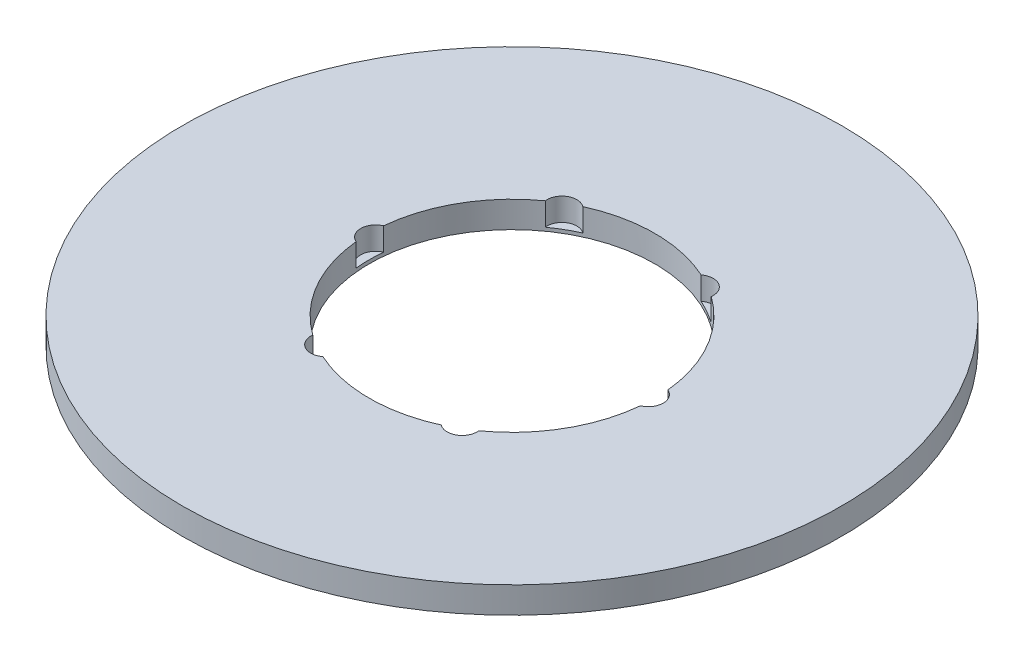
ISO-10303-21;
HEADER;
FILE_DESCRIPTION(('STEP AP214'),'2;1');
FILE_NAME('part.step','',(''),(''),'','','');
FILE_SCHEMA(('AUTOMOTIVE_DESIGN { 1 0 10303 214 1 1 1 1 }'));
ENDSEC;
DATA;
#1=APPLICATION_CONTEXT('core data for automotive mechanical design processes');
#2=APPLICATION_PROTOCOL_DEFINITION('international standard','automotive_design',2000,#1);
#3=PRODUCT_CONTEXT('',#1,'mechanical');
#4=PRODUCT('Part','Part','',(#3));
#5=PRODUCT_RELATED_PRODUCT_CATEGORY('part','',(#4));
#6=PRODUCT_DEFINITION_FORMATION('','',#4);
#7=PRODUCT_DEFINITION_CONTEXT('part definition',#1,'design');
#8=PRODUCT_DEFINITION('design','',#6,#7);
#9=PRODUCT_DEFINITION_SHAPE('','',#8);
#10=(LENGTH_UNIT() NAMED_UNIT(*) SI_UNIT(.MILLI.,.METRE.));
#11=(NAMED_UNIT(*) PLANE_ANGLE_UNIT() SI_UNIT($,.RADIAN.));
#12=(NAMED_UNIT(*) SI_UNIT($,.STERADIAN.) SOLID_ANGLE_UNIT());
#13=UNCERTAINTY_MEASURE_WITH_UNIT(LENGTH_MEASURE(1.E-05),#10,'distance_accuracy_value','');
#14=(GEOMETRIC_REPRESENTATION_CONTEXT(3) GLOBAL_UNCERTAINTY_ASSIGNED_CONTEXT((#13)) GLOBAL_UNIT_ASSIGNED_CONTEXT((#10,
#11,#12)) REPRESENTATION_CONTEXT('',''));
#15=CARTESIAN_POINT('',(0.,0.,0.));
#16=DIRECTION('',(0.,0.,1.));
#17=DIRECTION('',(1.,0.,0.));
#18=AXIS2_PLACEMENT_3D('',#15,#16,#17);
#19=CARTESIAN_POINT('',(0.,6.,0.));
#20=DIRECTION('',(0.,-1.,0.));
#21=DIRECTION('',(0.,0.,-1.));
#22=AXIS2_PLACEMENT_3D('',#19,#20,#21);
#23=CYLINDRICAL_SURFACE('',#22,75.);
#24=CARTESIAN_POINT('',(0.,6.,0.));
#25=DIRECTION('',(0.,1.,0.));
#26=DIRECTION('',(0.,0.,1.));
#27=AXIS2_PLACEMENT_3D('',#24,#25,#26);
#28=CIRCLE('',#27,75.);
#29=CARTESIAN_POINT('',(0.,6.,75.));
#30=VERTEX_POINT('',#29);
#31=EDGE_CURVE('E162',#30,#30,#28,.T.);
#32=ORIENTED_EDGE('',*,*,#31,.F.);
#33=EDGE_LOOP('',(#32));
#34=FACE_BOUND('',#33,.T.);
#35=CARTESIAN_POINT('',(0.,0.,0.));
#36=DIRECTION('',(0.,1.,0.));
#37=DIRECTION('',(0.,0.,1.));
#38=AXIS2_PLACEMENT_3D('',#35,#36,#37);
#39=CIRCLE('',#38,75.);
#40=CARTESIAN_POINT('',(0.,0.,75.));
#41=VERTEX_POINT('',#40);
#42=EDGE_CURVE('E157',#41,#41,#39,.T.);
#43=ORIENTED_EDGE('',*,*,#42,.T.);
#44=EDGE_LOOP('',(#43));
#45=FACE_BOUND('',#44,.T.);
#46=ADVANCED_FACE('F39',(#34,#45),#23,.T.);
#47=CARTESIAN_POINT('',(0.,6.,0.));
#48=DIRECTION('',(0.,1.,0.));
#49=DIRECTION('',(0.,0.,1.));
#50=AXIS2_PLACEMENT_3D('',#47,#48,#49);
#51=PLANE('',#50);
#52=CARTESIAN_POINT('',(-15.5174326304383,6.,-26.8769817189455));
#53=DIRECTION('',(0.,1.,0.));
#54=DIRECTION('',(-0.866025403784433,0.,0.50000000000001));
#55=AXIS2_PLACEMENT_3D('',#52,#53,#54);
#56=CIRCLE('',#55,3.39074899424197);
#57=CARTESIAN_POINT('',(-13.4678386696007,6.,-29.5781561556769));
#58=VERTEX_POINT('',#57);
#59=CARTESIAN_POINT('',(-18.8815152931195,6.,-26.4525684997827));
#60=VERTEX_POINT('',#59);
#61=EDGE_CURVE('E218',#58,#60,#56,.T.);
#62=ORIENTED_EDGE('',*,*,#61,.F.);
#63=CARTESIAN_POINT('',(0.,6.,0.));
#64=DIRECTION('',(0.,1.,0.));
#65=DIRECTION('',(0.,0.,1.));
#66=AXIS2_PLACEMENT_3D('',#63,#64,#65);
#67=CIRCLE('',#66,32.5);
#68=CARTESIAN_POINT('',(13.4678386696001,6.,-29.5781561556772));
#69=VERTEX_POINT('',#68);
#70=EDGE_CURVE('E169',#69,#58,#67,.T.);
#71=ORIENTED_EDGE('',*,*,#70,.F.);
#72=CARTESIAN_POINT('',(15.5174326304377,6.,-26.8769817189458));
#73=DIRECTION('',(0.,1.,0.));
#74=DIRECTION('',(-0.866025403784443,0.,-0.499999999999992));
#75=AXIS2_PLACEMENT_3D('',#72,#73,#74);
#76=CIRCLE('',#75,3.39074899424197);
#77=CARTESIAN_POINT('',(18.881515293119,6.,-26.452568499783));
#78=VERTEX_POINT('',#77);
#79=EDGE_CURVE('E285',#78,#69,#76,.T.);
#80=ORIENTED_EDGE('',*,*,#79,.F.);
#81=CARTESIAN_POINT('',(32.3493539627196,6.,-3.12558765589419));
#82=VERTEX_POINT('',#81);
#83=EDGE_CURVE('E174',#82,#78,#67,.T.);
#84=ORIENTED_EDGE('',*,*,#83,.F.);
#85=CARTESIAN_POINT('',(31.0348652608759,6.,0.));
#86=DIRECTION('',(0.,1.,0.));
#87=DIRECTION('',(0.,0.,-1.));
#88=AXIS2_PLACEMENT_3D('',#85,#86,#87);
#89=CIRCLE('',#88,3.39074899424197);
#90=CARTESIAN_POINT('',(32.3493539627196,6.,3.12558765589419));
#91=VERTEX_POINT('',#90);
#92=EDGE_CURVE('E280',#91,#82,#89,.T.);
#93=ORIENTED_EDGE('',*,*,#92,.F.);
#94=CARTESIAN_POINT('',(18.8815152931193,6.,26.4525684997828));
#95=VERTEX_POINT('',#94);
#96=EDGE_CURVE('E164',#95,#91,#67,.T.);
#97=ORIENTED_EDGE('',*,*,#96,.F.);
#98=CARTESIAN_POINT('',(15.5174326304381,6.,26.8769817189456));
#99=DIRECTION('',(0.,1.,0.));
#100=DIRECTION('',(0.866025403784436,0.,-0.500000000000004));
#101=AXIS2_PLACEMENT_3D('',#98,#99,#100);
#102=CIRCLE('',#101,3.39074899424197);
#103=CARTESIAN_POINT('',(13.4678386696005,6.,29.578156155677));
#104=VERTEX_POINT('',#103);
#105=EDGE_CURVE('E269',#104,#95,#102,.T.);
#106=ORIENTED_EDGE('',*,*,#105,.F.);
#107=CARTESIAN_POINT('',(-13.4678386696003,6.,29.5781561556771));
#108=VERTEX_POINT('',#107);
#109=EDGE_CURVE('E149',#108,#104,#67,.T.);
#110=ORIENTED_EDGE('',*,*,#109,.F.);
#111=CARTESIAN_POINT('',(-15.5174326304379,6.,26.8769817189457));
#112=DIRECTION('',(0.,1.,0.));
#113=DIRECTION('',(0.86602540378444,0.,0.499999999999998));
#114=AXIS2_PLACEMENT_3D('',#111,#112,#113);
#115=CIRCLE('',#114,3.39074899424197);
#116=CARTESIAN_POINT('',(-18.8815152931192,6.,26.4525684997829));
#117=VERTEX_POINT('',#116);
#118=EDGE_CURVE('E128',#117,#108,#115,.T.);
#119=ORIENTED_EDGE('',*,*,#118,.F.);
#120=CARTESIAN_POINT('',(-32.3493539627196,6.,3.12558765589419));
#121=VERTEX_POINT('',#120);
#122=EDGE_CURVE('E148',#121,#117,#67,.T.);
#123=ORIENTED_EDGE('',*,*,#122,.F.);
#124=CARTESIAN_POINT('',(-31.0348652608759,6.,0.));
#125=DIRECTION('',(0.,1.,0.));
#126=DIRECTION('',(0.,0.,1.));
#127=AXIS2_PLACEMENT_3D('',#124,#125,#126);
#128=CIRCLE('',#127,3.39074899424197);
#129=CARTESIAN_POINT('',(-32.3493539627196,6.,-3.12558765589419));
#130=VERTEX_POINT('',#129);
#131=EDGE_CURVE('E179',#130,#121,#128,.T.);
#132=ORIENTED_EDGE('',*,*,#131,.F.);
#133=EDGE_CURVE('E161',#60,#130,#67,.T.);
#134=ORIENTED_EDGE('',*,*,#133,.F.);
#135=EDGE_LOOP('',(#62,#71,#80,#84,#93,#97,#106,#110,#119,#123,#132,#134));
#136=FACE_BOUND('',#135,.T.);
#137=ORIENTED_EDGE('',*,*,#31,.T.);
#138=EDGE_LOOP('',(#137));
#139=FACE_BOUND('',#138,.T.);
#140=ADVANCED_FACE('F141',(#136,#139),#51,.T.);
#141=CARTESIAN_POINT('',(0.,0.,0.));
#142=DIRECTION('',(0.,1.,0.));
#143=DIRECTION('',(0.,0.,1.));
#144=AXIS2_PLACEMENT_3D('',#141,#142,#143);
#145=PLANE('',#144);
#146=CARTESIAN_POINT('',(0.,0.,0.));
#147=DIRECTION('',(0.,1.,0.));
#148=DIRECTION('',(0.,0.,1.));
#149=AXIS2_PLACEMENT_3D('',#146,#147,#148);
#150=CIRCLE('',#149,32.5);
#151=CARTESIAN_POINT('',(0.,0.,32.5));
#152=VERTEX_POINT('',#151);
#153=EDGE_CURVE('E166',#152,#152,#150,.T.);
#154=ORIENTED_EDGE('',*,*,#153,.T.);
#155=EDGE_LOOP('',(#154));
#156=FACE_BOUND('',#155,.T.);
#157=ORIENTED_EDGE('',*,*,#42,.F.);
#158=EDGE_LOOP('',(#157));
#159=FACE_BOUND('',#158,.T.);
#160=ADVANCED_FACE('F234',(#156,#159),#145,.F.);
#161=CARTESIAN_POINT('',(0.,6.,0.));
#162=DIRECTION('',(0.,-1.,0.));
#163=DIRECTION('',(0.,0.,-1.));
#164=AXIS2_PLACEMENT_3D('',#161,#162,#163);
#165=CYLINDRICAL_SURFACE('',#164,32.5);
#166=DIRECTION('',(0.,1.,0.));
#167=VECTOR('',#166,1.);
#168=CARTESIAN_POINT('',(-13.4678386696007,3.39763623002523,-29.5781561556769));
#169=LINE('',#168,#167);
#170=CARTESIAN_POINT('',(-13.4678386696007,0.795272460050466,-29.5781561556769));
#171=VERTEX_POINT('',#170);
#172=EDGE_CURVE('E11',#171,#58,#169,.T.);
#173=ORIENTED_EDGE('',*,*,#172,.F.);
#174=CARTESIAN_POINT('',(0.,0.795272460050466,0.));
#175=DIRECTION('',(0.,1.,0.));
#176=DIRECTION('',(0.,0.,1.));
#177=AXIS2_PLACEMENT_3D('',#174,#175,#176);
#178=CIRCLE('',#177,32.5);
#179=CARTESIAN_POINT('',(-18.8815152931195,0.795272460050466,-26.4525684997827));
#180=VERTEX_POINT('',#179);
#181=EDGE_CURVE('E214',#171,#180,#178,.T.);
#182=ORIENTED_EDGE('',*,*,#181,.T.);
#183=DIRECTION('',(0.,1.,0.));
#184=VECTOR('',#183,1.);
#185=CARTESIAN_POINT('',(-18.8815152931195,3.39763623002523,-26.4525684997827));
#186=LINE('',#185,#184);
#187=EDGE_CURVE('E46',#60,#180,#186,.F.);
#188=ORIENTED_EDGE('',*,*,#187,.F.);
#189=ORIENTED_EDGE('',*,*,#133,.T.);
#190=DIRECTION('',(0.,1.,0.));
#191=VECTOR('',#190,1.);
#192=CARTESIAN_POINT('',(-32.3493539627196,3.39763623002523,-3.12558765589419));
#193=LINE('',#192,#191);
#194=CARTESIAN_POINT('',(-32.3493539627196,0.795272460050466,-3.12558765589419));
#195=VERTEX_POINT('',#194);
#196=EDGE_CURVE('E187',#195,#130,#193,.T.);
#197=ORIENTED_EDGE('',*,*,#196,.F.);
#198=CARTESIAN_POINT('',(0.,0.795272460050466,0.));
#199=DIRECTION('',(0.,1.,0.));
#200=DIRECTION('',(0.,0.,1.));
#201=AXIS2_PLACEMENT_3D('',#198,#199,#200);
#202=CIRCLE('',#201,32.5);
#203=CARTESIAN_POINT('',(-32.3493539627196,0.795272460050466,3.12558765589419));
#204=VERTEX_POINT('',#203);
#205=EDGE_CURVE('E184',#195,#204,#202,.T.);
#206=ORIENTED_EDGE('',*,*,#205,.T.);
#207=DIRECTION('',(0.,1.,0.));
#208=VECTOR('',#207,1.);
#209=CARTESIAN_POINT('',(-32.3493539627196,3.39763623002523,3.12558765589419));
#210=LINE('',#209,#208);
#211=EDGE_CURVE('E158',#121,#204,#210,.F.);
#212=ORIENTED_EDGE('',*,*,#211,.F.);
#213=ORIENTED_EDGE('',*,*,#122,.T.);
#214=DIRECTION('',(0.,1.,0.));
#215=VECTOR('',#214,1.);
#216=CARTESIAN_POINT('',(-18.8815152931192,3.39763623002523,26.4525684997829));
#217=LINE('',#216,#215);
#218=CARTESIAN_POINT('',(-18.8815152931192,0.795272460050466,26.4525684997829));
#219=VERTEX_POINT('',#218);
#220=EDGE_CURVE('E127',#219,#117,#217,.T.);
#221=ORIENTED_EDGE('',*,*,#220,.F.);
#222=CARTESIAN_POINT('',(0.,0.795272460050466,0.));
#223=DIRECTION('',(0.,1.,0.));
#224=DIRECTION('',(0.,0.,1.));
#225=AXIS2_PLACEMENT_3D('',#222,#223,#224);
#226=CIRCLE('',#225,32.5);
#227=CARTESIAN_POINT('',(-13.4678386696003,0.795272460050466,29.5781561556771));
#228=VERTEX_POINT('',#227);
#229=EDGE_CURVE('E189',#219,#228,#226,.T.);
#230=ORIENTED_EDGE('',*,*,#229,.T.);
#231=DIRECTION('',(0.,1.,0.));
#232=VECTOR('',#231,1.);
#233=CARTESIAN_POINT('',(-13.4678386696003,3.39763623002523,29.5781561556771));
#234=LINE('',#233,#232);
#235=EDGE_CURVE('E140',#108,#228,#234,.F.);
#236=ORIENTED_EDGE('',*,*,#235,.F.);
#237=ORIENTED_EDGE('',*,*,#109,.T.);
#238=DIRECTION('',(0.,1.,0.));
#239=VECTOR('',#238,1.);
#240=CARTESIAN_POINT('',(13.4678386696005,3.39763623002523,29.578156155677));
#241=LINE('',#240,#239);
#242=CARTESIAN_POINT('',(13.4678386696005,0.795272460050466,29.578156155677));
#243=VERTEX_POINT('',#242);
#244=EDGE_CURVE('E196',#243,#104,#241,.T.);
#245=ORIENTED_EDGE('',*,*,#244,.F.);
#246=CARTESIAN_POINT('',(0.,0.795272460050466,0.));
#247=DIRECTION('',(0.,1.,0.));
#248=DIRECTION('',(0.,0.,1.));
#249=AXIS2_PLACEMENT_3D('',#246,#247,#248);
#250=CIRCLE('',#249,32.5);
#251=CARTESIAN_POINT('',(18.8815152931193,0.795272460050466,26.4525684997828));
#252=VERTEX_POINT('',#251);
#253=EDGE_CURVE('E136',#243,#252,#250,.T.);
#254=ORIENTED_EDGE('',*,*,#253,.T.);
#255=DIRECTION('',(0.,1.,0.));
#256=VECTOR('',#255,1.);
#257=CARTESIAN_POINT('',(18.8815152931193,3.39763623002523,26.4525684997828));
#258=LINE('',#257,#256);
#259=EDGE_CURVE('E194',#95,#252,#258,.F.);
#260=ORIENTED_EDGE('',*,*,#259,.F.);
#261=ORIENTED_EDGE('',*,*,#96,.T.);
#262=DIRECTION('',(0.,1.,0.));
#263=VECTOR('',#262,1.);
#264=CARTESIAN_POINT('',(32.3493539627196,3.39763623002523,3.12558765589419));
#265=LINE('',#264,#263);
#266=CARTESIAN_POINT('',(32.3493539627196,0.795272460050466,3.12558765589419));
#267=VERTEX_POINT('',#266);
#268=EDGE_CURVE('E206',#267,#91,#265,.T.);
#269=ORIENTED_EDGE('',*,*,#268,.F.);
#270=CARTESIAN_POINT('',(0.,0.795272460050466,0.));
#271=DIRECTION('',(0.,1.,0.));
#272=DIRECTION('',(0.,0.,1.));
#273=AXIS2_PLACEMENT_3D('',#270,#271,#272);
#274=CIRCLE('',#273,32.5);
#275=CARTESIAN_POINT('',(32.3493539627196,0.795272460050466,-3.12558765589419));
#276=VERTEX_POINT('',#275);
#277=EDGE_CURVE('E199',#267,#276,#274,.T.);
#278=ORIENTED_EDGE('',*,*,#277,.T.);
#279=DIRECTION('',(0.,1.,0.));
#280=VECTOR('',#279,1.);
#281=CARTESIAN_POINT('',(32.3493539627196,3.39763623002523,-3.12558765589419));
#282=LINE('',#281,#280);
#283=EDGE_CURVE('E201',#82,#276,#282,.F.);
#284=ORIENTED_EDGE('',*,*,#283,.F.);
#285=ORIENTED_EDGE('',*,*,#83,.T.);
#286=DIRECTION('',(0.,1.,0.));
#287=VECTOR('',#286,1.);
#288=CARTESIAN_POINT('',(18.881515293119,3.39763623002523,-26.4525684997831));
#289=LINE('',#288,#287);
#290=CARTESIAN_POINT('',(18.881515293119,0.795272460050466,-26.452568499783));
#291=VERTEX_POINT('',#290);
#292=EDGE_CURVE('E213',#291,#78,#289,.T.);
#293=ORIENTED_EDGE('',*,*,#292,.F.);
#294=CARTESIAN_POINT('',(0.,0.795272460050466,0.));
#295=DIRECTION('',(0.,1.,0.));
#296=DIRECTION('',(0.,0.,1.));
#297=AXIS2_PLACEMENT_3D('',#294,#295,#296);
#298=CIRCLE('',#297,32.5);
#299=CARTESIAN_POINT('',(13.4678386696001,0.795272460050466,-29.5781561556772));
#300=VERTEX_POINT('',#299);
#301=EDGE_CURVE('E208',#291,#300,#298,.T.);
#302=ORIENTED_EDGE('',*,*,#301,.T.);
#303=DIRECTION('',(0.,1.,0.));
#304=VECTOR('',#303,1.);
#305=CARTESIAN_POINT('',(13.4678386696001,3.39763623002523,-29.5781561556772));
#306=LINE('',#305,#304);
#307=EDGE_CURVE('E211',#69,#300,#306,.F.);
#308=ORIENTED_EDGE('',*,*,#307,.F.);
#309=ORIENTED_EDGE('',*,*,#70,.T.);
#310=EDGE_LOOP('',(#173,#182,#188,#189,#197,#206,#212,#213,#221,#230,#236,#237,#245,#254,#260,
#261,#269,#278,#284,#285,#293,#302,#308,#309));
#311=FACE_BOUND('',#310,.T.);
#312=ORIENTED_EDGE('',*,*,#153,.F.);
#313=EDGE_LOOP('',(#312));
#314=FACE_BOUND('',#313,.T.);
#315=ADVANCED_FACE('F152',(#311,#314),#165,.F.);
#316=CARTESIAN_POINT('',(-31.0348652608759,0.795272460050466,0.));
#317=DIRECTION('',(0.,1.,0.));
#318=DIRECTION('',(0.,0.,1.));
#319=AXIS2_PLACEMENT_3D('',#316,#317,#318);
#320=CYLINDRICAL_SURFACE('',#319,3.39074899424197);
#321=ORIENTED_EDGE('',*,*,#196,.T.);
#322=ORIENTED_EDGE('',*,*,#131,.T.);
#323=ORIENTED_EDGE('',*,*,#211,.T.);
#324=CARTESIAN_POINT('',(-31.0348652608759,0.795272460050466,0.));
#325=DIRECTION('',(0.,1.,0.));
#326=DIRECTION('',(0.,0.,1.));
#327=AXIS2_PLACEMENT_3D('',#324,#325,#326);
#328=CIRCLE('',#327,3.39074899424197);
#329=EDGE_CURVE('E180',#195,#204,#328,.T.);
#330=ORIENTED_EDGE('',*,*,#329,.F.);
#331=EDGE_LOOP('',(#321,#322,#323,#330));
#332=FACE_BOUND('',#331,.T.);
#333=ADVANCED_FACE('F244',(#332),#320,.F.);
#334=CARTESIAN_POINT('',(-31.0348652608759,0.795272460050466,0.));
#335=DIRECTION('',(0.,1.,0.));
#336=DIRECTION('',(0.,0.,1.));
#337=AXIS2_PLACEMENT_3D('',#334,#335,#336);
#338=PLANE('',#337);
#339=ORIENTED_EDGE('',*,*,#329,.T.);
#340=ORIENTED_EDGE('',*,*,#205,.F.);
#341=EDGE_LOOP('',(#339,#340));
#342=FACE_BOUND('',#341,.T.);
#343=ADVANCED_FACE('F248',(#342),#338,.T.);
#344=CARTESIAN_POINT('',(-15.5174326304379,0.795272460050466,26.8769817189457));
#345=DIRECTION('',(0.,1.,0.));
#346=DIRECTION('',(0.,0.,1.));
#347=AXIS2_PLACEMENT_3D('',#344,#345,#346);
#348=CYLINDRICAL_SURFACE('',#347,3.39074899424197);
#349=ORIENTED_EDGE('',*,*,#220,.T.);
#350=ORIENTED_EDGE('',*,*,#118,.T.);
#351=ORIENTED_EDGE('',*,*,#235,.T.);
#352=CARTESIAN_POINT('',(-15.5174326304379,0.795272460050466,26.8769817189457));
#353=DIRECTION('',(0.,1.,0.));
#354=DIRECTION('',(0.86602540378444,0.,0.499999999999998));
#355=AXIS2_PLACEMENT_3D('',#352,#353,#354);
#356=CIRCLE('',#355,3.39074899424197);
#357=EDGE_CURVE('E135',#219,#228,#356,.T.);
#358=ORIENTED_EDGE('',*,*,#357,.F.);
#359=EDGE_LOOP('',(#349,#350,#351,#358));
#360=FACE_BOUND('',#359,.T.);
#361=ADVANCED_FACE('F126',(#360),#348,.F.);
#362=CARTESIAN_POINT('',(-15.5174326304379,0.795272460050466,26.8769817189457));
#363=DIRECTION('',(0.,1.,0.));
#364=DIRECTION('',(0.86602540378444,0.,0.499999999999998));
#365=AXIS2_PLACEMENT_3D('',#362,#363,#364);
#366=PLANE('',#365);
#367=ORIENTED_EDGE('',*,*,#357,.T.);
#368=ORIENTED_EDGE('',*,*,#229,.F.);
#369=EDGE_LOOP('',(#367,#368));
#370=FACE_BOUND('',#369,.T.);
#371=ADVANCED_FACE('F258',(#370),#366,.T.);
#372=CARTESIAN_POINT('',(15.5174326304381,0.795272460050466,26.8769817189456));
#373=DIRECTION('',(0.,1.,0.));
#374=DIRECTION('',(0.,0.,1.));
#375=AXIS2_PLACEMENT_3D('',#372,#373,#374);
#376=CYLINDRICAL_SURFACE('',#375,3.39074899424197);
#377=ORIENTED_EDGE('',*,*,#244,.T.);
#378=ORIENTED_EDGE('',*,*,#105,.T.);
#379=ORIENTED_EDGE('',*,*,#259,.T.);
#380=CARTESIAN_POINT('',(15.5174326304381,0.795272460050466,26.8769817189456));
#381=DIRECTION('',(0.,1.,0.));
#382=DIRECTION('',(0.866025403784436,0.,-0.500000000000004));
#383=AXIS2_PLACEMENT_3D('',#380,#381,#382);
#384=CIRCLE('',#383,3.39074899424197);
#385=EDGE_CURVE('E147',#243,#252,#384,.T.);
#386=ORIENTED_EDGE('',*,*,#385,.F.);
#387=EDGE_LOOP('',(#377,#378,#379,#386));
#388=FACE_BOUND('',#387,.T.);
#389=ADVANCED_FACE('F256',(#388),#376,.F.);
#390=CARTESIAN_POINT('',(15.5174326304381,0.795272460050466,26.8769817189456));
#391=DIRECTION('',(0.,1.,0.));
#392=DIRECTION('',(0.866025403784436,0.,-0.500000000000004));
#393=AXIS2_PLACEMENT_3D('',#390,#391,#392);
#394=PLANE('',#393);
#395=ORIENTED_EDGE('',*,*,#385,.T.);
#396=ORIENTED_EDGE('',*,*,#253,.F.);
#397=EDGE_LOOP('',(#395,#396));
#398=FACE_BOUND('',#397,.T.);
#399=ADVANCED_FACE('F263',(#398),#394,.T.);
#400=CARTESIAN_POINT('',(31.0348652608759,0.795272460050466,0.));
#401=DIRECTION('',(0.,1.,0.));
#402=DIRECTION('',(0.,0.,1.));
#403=AXIS2_PLACEMENT_3D('',#400,#401,#402);
#404=CYLINDRICAL_SURFACE('',#403,3.39074899424197);
#405=ORIENTED_EDGE('',*,*,#268,.T.);
#406=ORIENTED_EDGE('',*,*,#92,.T.);
#407=ORIENTED_EDGE('',*,*,#283,.T.);
#408=CARTESIAN_POINT('',(31.0348652608759,0.795272460050466,0.));
#409=DIRECTION('',(0.,1.,0.));
#410=DIRECTION('',(0.,0.,-1.));
#411=AXIS2_PLACEMENT_3D('',#408,#409,#410);
#412=CIRCLE('',#411,3.39074899424197);
#413=EDGE_CURVE('E273',#267,#276,#412,.T.);
#414=ORIENTED_EDGE('',*,*,#413,.F.);
#415=EDGE_LOOP('',(#405,#406,#407,#414));
#416=FACE_BOUND('',#415,.T.);
#417=ADVANCED_FACE('F297',(#416),#404,.F.);
#418=CARTESIAN_POINT('',(31.0348652608759,0.795272460050466,0.));
#419=DIRECTION('',(0.,1.,0.));
#420=DIRECTION('',(0.,0.,-1.));
#421=AXIS2_PLACEMENT_3D('',#418,#419,#420);
#422=PLANE('',#421);
#423=ORIENTED_EDGE('',*,*,#413,.T.);
#424=ORIENTED_EDGE('',*,*,#277,.F.);
#425=EDGE_LOOP('',(#423,#424));
#426=FACE_BOUND('',#425,.T.);
#427=ADVANCED_FACE('F299',(#426),#422,.T.);
#428=CARTESIAN_POINT('',(15.5174326304377,0.795272460050466,-26.8769817189458));
#429=DIRECTION('',(0.,1.,0.));
#430=DIRECTION('',(0.,0.,1.));
#431=AXIS2_PLACEMENT_3D('',#428,#429,#430);
#432=CYLINDRICAL_SURFACE('',#431,3.39074899424197);
#433=ORIENTED_EDGE('',*,*,#292,.T.);
#434=ORIENTED_EDGE('',*,*,#79,.T.);
#435=ORIENTED_EDGE('',*,*,#307,.T.);
#436=CARTESIAN_POINT('',(15.5174326304377,0.795272460050466,-26.8769817189458));
#437=DIRECTION('',(0.,1.,0.));
#438=DIRECTION('',(-0.866025403784443,0.,-0.499999999999992));
#439=AXIS2_PLACEMENT_3D('',#436,#437,#438);
#440=CIRCLE('',#439,3.39074899424197);
#441=EDGE_CURVE('E56',#291,#300,#440,.T.);
#442=ORIENTED_EDGE('',*,*,#441,.F.);
#443=EDGE_LOOP('',(#433,#434,#435,#442));
#444=FACE_BOUND('',#443,.T.);
#445=ADVANCED_FACE('F292',(#444),#432,.F.);
#446=CARTESIAN_POINT('',(15.5174326304377,0.795272460050466,-26.8769817189458));
#447=DIRECTION('',(0.,1.,0.));
#448=DIRECTION('',(-0.866025403784443,0.,-0.499999999999992));
#449=AXIS2_PLACEMENT_3D('',#446,#447,#448);
#450=PLANE('',#449);
#451=ORIENTED_EDGE('',*,*,#441,.T.);
#452=ORIENTED_EDGE('',*,*,#301,.F.);
#453=EDGE_LOOP('',(#451,#452));
#454=FACE_BOUND('',#453,.T.);
#455=ADVANCED_FACE('F226',(#454),#450,.T.);
#456=CARTESIAN_POINT('',(-15.5174326304383,0.795272460050466,-26.8769817189455));
#457=DIRECTION('',(0.,1.,0.));
#458=DIRECTION('',(0.,0.,1.));
#459=AXIS2_PLACEMENT_3D('',#456,#457,#458);
#460=CYLINDRICAL_SURFACE('',#459,3.39074899424197);
#461=ORIENTED_EDGE('',*,*,#172,.T.);
#462=ORIENTED_EDGE('',*,*,#61,.T.);
#463=ORIENTED_EDGE('',*,*,#187,.T.);
#464=CARTESIAN_POINT('',(-15.5174326304383,0.795272460050466,-26.8769817189455));
#465=DIRECTION('',(0.,1.,0.));
#466=DIRECTION('',(-0.866025403784433,0.,0.50000000000001));
#467=AXIS2_PLACEMENT_3D('',#464,#465,#466);
#468=CIRCLE('',#467,3.39074899424197);
#469=EDGE_CURVE('E55',#171,#180,#468,.T.);
#470=ORIENTED_EDGE('',*,*,#469,.F.);
#471=EDGE_LOOP('',(#461,#462,#463,#470));
#472=FACE_BOUND('',#471,.T.);
#473=ADVANCED_FACE('F217',(#472),#460,.F.);
#474=CARTESIAN_POINT('',(-15.5174326304383,0.795272460050466,-26.8769817189455));
#475=DIRECTION('',(0.,1.,0.));
#476=DIRECTION('',(-0.866025403784433,0.,0.50000000000001));
#477=AXIS2_PLACEMENT_3D('',#474,#475,#476);
#478=PLANE('',#477);
#479=ORIENTED_EDGE('',*,*,#469,.T.);
#480=ORIENTED_EDGE('',*,*,#181,.F.);
#481=EDGE_LOOP('',(#479,#480));
#482=FACE_BOUND('',#481,.T.);
#483=ADVANCED_FACE('F219',(#482),#478,.T.);
#484=CLOSED_SHELL('',(#46,#140,#160,#315,#333,#343,#361,#371,#389,#399,#417,#427,#445,#455,#473,#483));
#485=MANIFOLD_SOLID_BREP('B2',#484);
#486=ADVANCED_BREP_SHAPE_REPRESENTATION('',(#18,#485),#14);
#487=SHAPE_DEFINITION_REPRESENTATION(#9,#486);
ENDSEC;
END-ISO-10303-21;
